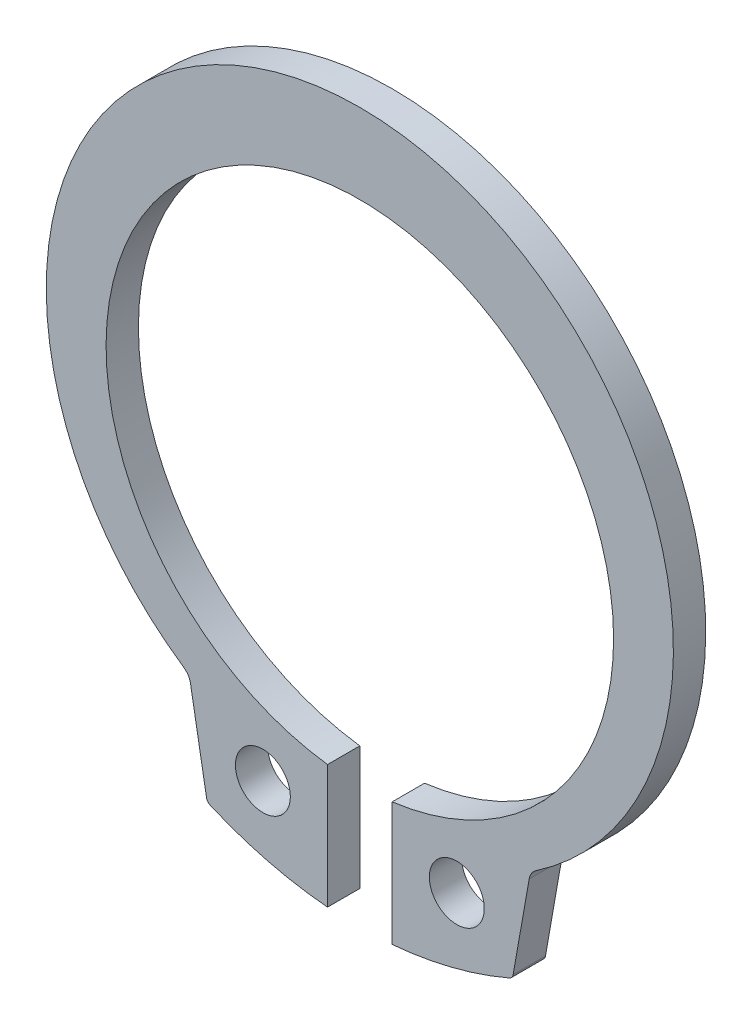
ISO-10303-21;
HEADER;
FILE_DESCRIPTION(('STEP AP214'),'2;1');
FILE_NAME('part.step','',(''),(''),'','','');
FILE_SCHEMA(('AUTOMOTIVE_DESIGN { 1 0 10303 214 1 1 1 1 }'));
ENDSEC;
DATA;
#1=APPLICATION_CONTEXT('core data for automotive mechanical design processes');
#2=APPLICATION_PROTOCOL_DEFINITION('international standard','automotive_design',2000,#1);
#3=PRODUCT_CONTEXT('',#1,'mechanical');
#4=PRODUCT('Part','Part','',(#3));
#5=PRODUCT_RELATED_PRODUCT_CATEGORY('part','',(#4));
#6=PRODUCT_DEFINITION_FORMATION('','',#4);
#7=PRODUCT_DEFINITION_CONTEXT('part definition',#1,'design');
#8=PRODUCT_DEFINITION('design','',#6,#7);
#9=PRODUCT_DEFINITION_SHAPE('','',#8);
#10=(LENGTH_UNIT() NAMED_UNIT(*) SI_UNIT(.MILLI.,.METRE.));
#11=(NAMED_UNIT(*) PLANE_ANGLE_UNIT() SI_UNIT($,.RADIAN.));
#12=(NAMED_UNIT(*) SI_UNIT($,.STERADIAN.) SOLID_ANGLE_UNIT());
#13=UNCERTAINTY_MEASURE_WITH_UNIT(LENGTH_MEASURE(1.E-05),#10,'distance_accuracy_value','');
#14=(GEOMETRIC_REPRESENTATION_CONTEXT(3) GLOBAL_UNCERTAINTY_ASSIGNED_CONTEXT((#13)) GLOBAL_UNIT_ASSIGNED_CONTEXT((#10,
#11,#12)) REPRESENTATION_CONTEXT('',''));
#15=CARTESIAN_POINT('',(0.,0.,0.));
#16=DIRECTION('',(0.,0.,1.));
#17=DIRECTION('',(1.,0.,0.));
#18=AXIS2_PLACEMENT_3D('',#15,#16,#17);
#19=CARTESIAN_POINT('',(0.,-0.62,-1.));
#20=DIRECTION('',(0.,0.,1.));
#21=DIRECTION('',(1.,0.,0.));
#22=AXIS2_PLACEMENT_3D('',#19,#20,#21);
#23=CYLINDRICAL_SURFACE('',#22,11.65);
#24=CARTESIAN_POINT('',(0.,-0.62,-1.));
#25=DIRECTION('',(0.,0.,1.));
#26=DIRECTION('',(-1.,0.,0.));
#27=AXIS2_PLACEMENT_3D('',#24,#25,#26);
#28=CIRCLE('',#27,11.65);
#29=CARTESIAN_POINT('',(1.,-12.2270021969499,-1.));
#30=VERTEX_POINT('',#29);
#31=CARTESIAN_POINT('',(4.62513197829559,-11.3125513411602,-1.));
#32=VERTEX_POINT('',#31);
#33=EDGE_CURVE('E174',#30,#32,#28,.T.);
#34=ORIENTED_EDGE('',*,*,#33,.T.);
#35=DIRECTION('',(0.,0.,1.));
#36=VECTOR('',#35,1.);
#37=CARTESIAN_POINT('',(4.62513197829559,-11.3125513411602,-1.));
#38=LINE('',#37,#36);
#39=CARTESIAN_POINT('',(4.62513197829559,-11.3125513411602,0.));
#40=VERTEX_POINT('',#39);
#41=EDGE_CURVE('E192',#32,#40,#38,.T.);
#42=ORIENTED_EDGE('',*,*,#41,.T.);
#43=CARTESIAN_POINT('',(0.,-0.62,0.));
#44=DIRECTION('',(0.,0.,1.));
#45=DIRECTION('',(-1.,0.,0.));
#46=AXIS2_PLACEMENT_3D('',#43,#44,#45);
#47=CIRCLE('',#46,11.65);
#48=CARTESIAN_POINT('',(1.,-12.2270021969499,0.));
#49=VERTEX_POINT('',#48);
#50=EDGE_CURVE('E154',#49,#40,#47,.T.);
#51=ORIENTED_EDGE('',*,*,#50,.F.);
#52=DIRECTION('',(0.,0.,1.));
#53=VECTOR('',#52,1.);
#54=CARTESIAN_POINT('',(1.,-12.2270021969499,-1.));
#55=LINE('',#54,#53);
#56=EDGE_CURVE('E175',#30,#49,#55,.T.);
#57=ORIENTED_EDGE('',*,*,#56,.F.);
#58=EDGE_LOOP('',(#34,#42,#51,#57));
#59=FACE_BOUND('',#58,.T.);
#60=ADVANCED_FACE('F33',(#59),#23,.T.);
#61=CARTESIAN_POINT('',(1.,-8.40604520921886,-1.));
#62=DIRECTION('',(-1.,0.,0.));
#63=DIRECTION('',(0.,0.,1.));
#64=AXIS2_PLACEMENT_3D('',#61,#62,#63);
#65=PLANE('',#64);
#66=DIRECTION('',(0.,-1.,0.));
#67=VECTOR('',#66,1.);
#68=CARTESIAN_POINT('',(1.,-8.40604520921886,0.));
#69=LINE('',#68,#67);
#70=CARTESIAN_POINT('',(1.,-8.40604520921886,0.));
#71=VERTEX_POINT('',#70);
#72=EDGE_CURVE('E171',#71,#49,#69,.T.);
#73=ORIENTED_EDGE('',*,*,#72,.F.);
#74=DIRECTION('',(0.,0.,1.));
#75=VECTOR('',#74,1.);
#76=CARTESIAN_POINT('',(1.,-8.40604520921886,-1.));
#77=LINE('',#76,#75);
#78=CARTESIAN_POINT('',(1.,-8.40604520921886,-1.));
#79=VERTEX_POINT('',#78);
#80=EDGE_CURVE('E178',#79,#71,#77,.T.);
#81=ORIENTED_EDGE('',*,*,#80,.F.);
#82=DIRECTION('',(0.,-1.,0.));
#83=VECTOR('',#82,1.);
#84=CARTESIAN_POINT('',(1.,-8.40604520921886,-1.));
#85=LINE('',#84,#83);
#86=EDGE_CURVE('E141',#79,#30,#85,.T.);
#87=ORIENTED_EDGE('',*,*,#86,.T.);
#88=ORIENTED_EDGE('',*,*,#56,.T.);
#89=EDGE_LOOP('',(#73,#81,#87,#88));
#90=FACE_BOUND('',#89,.T.);
#91=ADVANCED_FACE('F273',(#90),#65,.T.);
#92=CARTESIAN_POINT('',(0.,-0.62,-1.));
#93=DIRECTION('',(0.,0.,1.));
#94=DIRECTION('',(1.,0.,0.));
#95=AXIS2_PLACEMENT_3D('',#92,#93,#94);
#96=CYLINDRICAL_SURFACE('',#95,7.85);
#97=CARTESIAN_POINT('',(0.,-0.62,0.));
#98=DIRECTION('',(0.,0.,-1.));
#99=DIRECTION('',(1.,0.,0.));
#100=AXIS2_PLACEMENT_3D('',#97,#98,#99);
#101=CIRCLE('',#100,7.85);
#102=CARTESIAN_POINT('',(-1.00000000000001,-8.40604520921886,0.));
#103=VERTEX_POINT('',#102);
#104=EDGE_CURVE('E168',#103,#71,#101,.T.);
#105=ORIENTED_EDGE('',*,*,#104,.F.);
#106=DIRECTION('',(0.,0.,1.));
#107=VECTOR('',#106,1.);
#108=CARTESIAN_POINT('',(-1.00000000000001,-8.40604520921886,-1.));
#109=LINE('',#108,#107);
#110=CARTESIAN_POINT('',(-1.00000000000001,-8.40604520921886,-1.));
#111=VERTEX_POINT('',#110);
#112=EDGE_CURVE('E140',#111,#103,#109,.T.);
#113=ORIENTED_EDGE('',*,*,#112,.F.);
#114=CARTESIAN_POINT('',(0.,-0.62,-1.));
#115=DIRECTION('',(0.,0.,-1.));
#116=DIRECTION('',(1.,0.,0.));
#117=AXIS2_PLACEMENT_3D('',#114,#115,#116);
#118=CIRCLE('',#117,7.85);
#119=EDGE_CURVE('E147',#111,#79,#118,.T.);
#120=ORIENTED_EDGE('',*,*,#119,.T.);
#121=ORIENTED_EDGE('',*,*,#80,.T.);
#122=EDGE_LOOP('',(#105,#113,#120,#121));
#123=FACE_BOUND('',#122,.T.);
#124=ADVANCED_FACE('F279',(#123),#96,.F.);
#125=CARTESIAN_POINT('',(-1.,-8.40604520921886,-1.));
#126=DIRECTION('',(1.,0.,0.));
#127=DIRECTION('',(0.,0.,-1.));
#128=AXIS2_PLACEMENT_3D('',#125,#126,#127);
#129=PLANE('',#128);
#130=DIRECTION('',(0.,1.,0.));
#131=VECTOR('',#130,1.);
#132=CARTESIAN_POINT('',(-1.,-8.40604520921886,0.));
#133=LINE('',#132,#131);
#134=CARTESIAN_POINT('',(-1.,-12.2270021969499,0.));
#135=VERTEX_POINT('',#134);
#136=EDGE_CURVE('E139',#135,#103,#133,.T.);
#137=ORIENTED_EDGE('',*,*,#136,.F.);
#138=DIRECTION('',(0.,0.,1.));
#139=VECTOR('',#138,1.);
#140=CARTESIAN_POINT('',(-1.,-12.2270021969499,-1.));
#141=LINE('',#140,#139);
#142=CARTESIAN_POINT('',(-1.,-12.2270021969499,-1.));
#143=VERTEX_POINT('',#142);
#144=EDGE_CURVE('E124',#143,#135,#141,.T.);
#145=ORIENTED_EDGE('',*,*,#144,.F.);
#146=DIRECTION('',(0.,1.,0.));
#147=VECTOR('',#146,1.);
#148=CARTESIAN_POINT('',(-1.,-8.40604520921886,-1.));
#149=LINE('',#148,#147);
#150=EDGE_CURVE('E132',#143,#111,#149,.T.);
#151=ORIENTED_EDGE('',*,*,#150,.T.);
#152=ORIENTED_EDGE('',*,*,#112,.T.);
#153=EDGE_LOOP('',(#137,#145,#151,#152));
#154=FACE_BOUND('',#153,.T.);
#155=ADVANCED_FACE('F137',(#154),#129,.T.);
#156=CARTESIAN_POINT('',(0.,-0.62,-1.));
#157=DIRECTION('',(0.,0.,1.));
#158=DIRECTION('',(1.,0.,0.));
#159=AXIS2_PLACEMENT_3D('',#156,#157,#158);
#160=CYLINDRICAL_SURFACE('',#159,11.65);
#161=CARTESIAN_POINT('',(0.,-0.62,0.));
#162=DIRECTION('',(0.,0.,1.));
#163=DIRECTION('',(1.,0.,0.));
#164=AXIS2_PLACEMENT_3D('',#161,#162,#163);
#165=CIRCLE('',#164,11.65);
#166=CARTESIAN_POINT('',(-4.62513197829559,-11.3125513411602,0.));
#167=VERTEX_POINT('',#166);
#168=EDGE_CURVE('E165',#167,#135,#165,.T.);
#169=ORIENTED_EDGE('',*,*,#168,.F.);
#170=DIRECTION('',(0.,0.,1.));
#171=VECTOR('',#170,1.);
#172=CARTESIAN_POINT('',(-4.62513197829559,-11.3125513411602,-1.));
#173=LINE('',#172,#171);
#174=CARTESIAN_POINT('',(-4.62513197829559,-11.3125513411602,-1.));
#175=VERTEX_POINT('',#174);
#176=EDGE_CURVE('E127',#167,#175,#173,.F.);
#177=ORIENTED_EDGE('',*,*,#176,.T.);
#178=CARTESIAN_POINT('',(0.,-0.62,-1.));
#179=DIRECTION('',(0.,0.,1.));
#180=DIRECTION('',(1.,0.,0.));
#181=AXIS2_PLACEMENT_3D('',#178,#179,#180);
#182=CIRCLE('',#181,11.65);
#183=EDGE_CURVE('E120',#175,#143,#182,.T.);
#184=ORIENTED_EDGE('',*,*,#183,.T.);
#185=ORIENTED_EDGE('',*,*,#144,.T.);
#186=EDGE_LOOP('',(#169,#177,#184,#185));
#187=FACE_BOUND('',#186,.T.);
#188=ADVANCED_FACE('F123',(#187),#160,.T.);
#189=CARTESIAN_POINT('',(-5.27590710666714,-8.13970541247158,-1.));
#190=DIRECTION('',(-0.984807753012208,-0.173648177666931,0.));
#191=DIRECTION('',(0.173648177666931,-0.984807753012208,0.));
#192=AXIS2_PLACEMENT_3D('',#189,#190,#191);
#193=PLANE('',#192);
#194=DIRECTION('',(0.173648177666931,-0.984807753012208,0.));
#195=VECTOR('',#194,1.);
#196=CARTESIAN_POINT('',(-5.27590710666714,-8.13970541247158,0.));
#197=LINE('',#196,#195);
#198=CARTESIAN_POINT('',(-5.23867219940351,-8.35087506509092,0.));
#199=VERTEX_POINT('',#198);
#200=CARTESIAN_POINT('',(-4.74269212154532,-11.1637178635407,0.));
#201=VERTEX_POINT('',#200);
#202=EDGE_CURVE('E163',#199,#201,#197,.T.);
#203=ORIENTED_EDGE('',*,*,#202,.F.);
#204=DIRECTION('',(0.,0.,-1.));
#205=VECTOR('',#204,1.);
#206=CARTESIAN_POINT('',(-5.23867219940351,-8.35087506509092,-1.));
#207=LINE('',#206,#205);
#208=CARTESIAN_POINT('',(-5.23867219940351,-8.35087506509092,-1.));
#209=VERTEX_POINT('',#208);
#210=EDGE_CURVE('E54',#199,#209,#207,.T.);
#211=ORIENTED_EDGE('',*,*,#210,.T.);
#212=DIRECTION('',(0.173648177666931,-0.984807753012208,0.));
#213=VECTOR('',#212,1.);
#214=CARTESIAN_POINT('',(-5.27590710666714,-8.13970541247158,-1.));
#215=LINE('',#214,#213);
#216=CARTESIAN_POINT('',(-4.74269212154532,-11.1637178635407,-1.));
#217=VERTEX_POINT('',#216);
#218=EDGE_CURVE('E133',#209,#217,#215,.T.);
#219=ORIENTED_EDGE('',*,*,#218,.T.);
#220=DIRECTION('',(0.,0.,1.));
#221=VECTOR('',#220,1.);
#222=CARTESIAN_POINT('',(-4.74269212154532,-11.1637178635407,-1.));
#223=LINE('',#222,#221);
#224=EDGE_CURVE('E177',#217,#201,#223,.T.);
#225=ORIENTED_EDGE('',*,*,#224,.T.);
#226=EDGE_LOOP('',(#203,#211,#219,#225));
#227=FACE_BOUND('',#226,.T.);
#228=ADVANCED_FACE('F332',(#227),#193,.T.);
#229=CARTESIAN_POINT('',(0.,0.,-1.));
#230=DIRECTION('',(0.,0.,1.));
#231=DIRECTION('',(1.,0.,0.));
#232=AXIS2_PLACEMENT_3D('',#229,#230,#231);
#233=CYLINDRICAL_SURFACE('',#232,9.7);
#234=CARTESIAN_POINT('',(0.,0.,0.));
#235=DIRECTION('',(0.,0.,1.));
#236=DIRECTION('',(1.,0.,0.));
#237=AXIS2_PLACEMENT_3D('',#234,#235,#236);
#238=CIRCLE('',#237,9.7);
#239=CARTESIAN_POINT('',(5.45014097414934,-8.02408645030065,0.));
#240=VERTEX_POINT('',#239);
#241=CARTESIAN_POINT('',(-5.45014097414934,-8.02408645030065,0.));
#242=VERTEX_POINT('',#241);
#243=EDGE_CURVE('E161',#240,#242,#238,.T.);
#244=ORIENTED_EDGE('',*,*,#243,.F.);
#245=DIRECTION('',(0.,0.,1.));
#246=VECTOR('',#245,1.);
#247=CARTESIAN_POINT('',(5.45014097414934,-8.02408645030065,-1.));
#248=LINE('',#247,#246);
#249=CARTESIAN_POINT('',(5.45014097414934,-8.02408645030065,-1.));
#250=VERTEX_POINT('',#249);
#251=EDGE_CURVE('E203',#240,#250,#248,.F.);
#252=ORIENTED_EDGE('',*,*,#251,.T.);
#253=CARTESIAN_POINT('',(0.,0.,-1.));
#254=DIRECTION('',(0.,0.,1.));
#255=DIRECTION('',(1.,0.,0.));
#256=AXIS2_PLACEMENT_3D('',#253,#254,#255);
#257=CIRCLE('',#256,9.7);
#258=CARTESIAN_POINT('',(-5.45014097414934,-8.02408645030065,-1.));
#259=VERTEX_POINT('',#258);
#260=EDGE_CURVE('E216',#250,#259,#257,.T.);
#261=ORIENTED_EDGE('',*,*,#260,.T.);
#262=DIRECTION('',(0.,0.,1.));
#263=VECTOR('',#262,1.);
#264=CARTESIAN_POINT('',(-5.45014097414934,-8.02408645030065,-1.));
#265=LINE('',#264,#263);
#266=EDGE_CURVE('E200',#259,#242,#265,.T.);
#267=ORIENTED_EDGE('',*,*,#266,.T.);
#268=EDGE_LOOP('',(#244,#252,#261,#267));
#269=FACE_BOUND('',#268,.T.);
#270=ADVANCED_FACE('F229',(#269),#233,.T.);
#271=CARTESIAN_POINT('',(5.27590710666714,-8.13970541247158,-1.));
#272=DIRECTION('',(0.984807753012208,-0.173648177666931,0.));
#273=DIRECTION('',(0.173648177666931,0.984807753012208,0.));
#274=AXIS2_PLACEMENT_3D('',#271,#272,#273);
#275=PLANE('',#274);
#276=DIRECTION('',(0.173648177666931,0.984807753012208,0.));
#277=VECTOR('',#276,1.);
#278=CARTESIAN_POINT('',(5.27590710666714,-8.13970541247158,-1.));
#279=LINE('',#278,#277);
#280=CARTESIAN_POINT('',(4.74269212154532,-11.1637178635407,-1.));
#281=VERTEX_POINT('',#280);
#282=CARTESIAN_POINT('',(5.23867219940351,-8.35087506509092,-1.));
#283=VERTEX_POINT('',#282);
#284=EDGE_CURVE('E213',#281,#283,#279,.T.);
#285=ORIENTED_EDGE('',*,*,#284,.T.);
#286=DIRECTION('',(0.,0.,-1.));
#287=VECTOR('',#286,1.);
#288=CARTESIAN_POINT('',(5.23867219940351,-8.35087506509092,0.));
#289=LINE('',#288,#287);
#290=CARTESIAN_POINT('',(5.23867219940351,-8.35087506509092,0.));
#291=VERTEX_POINT('',#290);
#292=EDGE_CURVE('E197',#283,#291,#289,.F.);
#293=ORIENTED_EDGE('',*,*,#292,.T.);
#294=DIRECTION('',(0.173648177666931,0.984807753012208,0.));
#295=VECTOR('',#294,1.);
#296=CARTESIAN_POINT('',(5.27590710666714,-8.13970541247158,0.));
#297=LINE('',#296,#295);
#298=CARTESIAN_POINT('',(4.74269212154532,-11.1637178635407,0.));
#299=VERTEX_POINT('',#298);
#300=EDGE_CURVE('E157',#299,#291,#297,.T.);
#301=ORIENTED_EDGE('',*,*,#300,.F.);
#302=DIRECTION('',(0.,0.,1.));
#303=VECTOR('',#302,1.);
#304=CARTESIAN_POINT('',(4.74269212154532,-11.1637178635407,-1.));
#305=LINE('',#304,#303);
#306=EDGE_CURVE('E195',#299,#281,#305,.F.);
#307=ORIENTED_EDGE('',*,*,#306,.T.);
#308=EDGE_LOOP('',(#285,#293,#301,#307));
#309=FACE_BOUND('',#308,.T.);
#310=ADVANCED_FACE('F221',(#309),#275,.T.);
#311=CARTESIAN_POINT('',(0.,-0.62,-1.));
#312=DIRECTION('',(0.,0.,-1.));
#313=DIRECTION('',(-1.,0.,0.));
#314=AXIS2_PLACEMENT_3D('',#311,#312,#313);
#315=PLANE('',#314);
#316=CARTESIAN_POINT('',(3.,-9.84442410126507,-1.));
#317=DIRECTION('',(0.,0.,1.));
#318=DIRECTION('',(-1.,0.,0.));
#319=AXIS2_PLACEMENT_3D('',#316,#317,#318);
#320=CIRCLE('',#319,0.85);
#321=CARTESIAN_POINT('',(2.15,-9.84442410126507,-1.));
#322=VERTEX_POINT('',#321);
#323=EDGE_CURVE('E241',#322,#322,#320,.T.);
#324=ORIENTED_EDGE('',*,*,#323,.T.);
#325=EDGE_LOOP('',(#324));
#326=FACE_BOUND('',#325,.T.);
#327=CARTESIAN_POINT('',(-3.,-9.84442410126507,-1.));
#328=DIRECTION('',(0.,0.,1.));
#329=DIRECTION('',(1.,0.,0.));
#330=AXIS2_PLACEMENT_3D('',#327,#328,#329);
#331=CIRCLE('',#330,0.85);
#332=CARTESIAN_POINT('',(-2.15,-9.84442410126507,-1.));
#333=VERTEX_POINT('',#332);
#334=EDGE_CURVE('E158',#333,#333,#331,.T.);
#335=ORIENTED_EDGE('',*,*,#334,.T.);
#336=EDGE_LOOP('',(#335));
#337=FACE_BOUND('',#336,.T.);
#338=ORIENTED_EDGE('',*,*,#183,.F.);
#339=CARTESIAN_POINT('',(-4.54573057094288,-11.1289882280073,-1.));
#340=DIRECTION('',(0.,0.,-1.));
#341=DIRECTION('',(-1.,0.,0.));
#342=AXIS2_PLACEMENT_3D('',#339,#340,#341);
#343=CIRCLE('',#342,0.2);
#344=EDGE_CURVE('E190',#175,#217,#343,.T.);
#345=ORIENTED_EDGE('',*,*,#344,.T.);
#346=ORIENTED_EDGE('',*,*,#218,.F.);
#347=CARTESIAN_POINT('',(-5.73107607590962,-8.43769915392439,-1.));
#348=DIRECTION('',(0.,0.,-1.));
#349=DIRECTION('',(-1.,0.,0.));
#350=AXIS2_PLACEMENT_3D('',#347,#348,#349);
#351=CIRCLE('',#350,0.5);
#352=EDGE_CURVE('E11',#209,#259,#351,.F.);
#353=ORIENTED_EDGE('',*,*,#352,.T.);
#354=ORIENTED_EDGE('',*,*,#260,.F.);
#355=CARTESIAN_POINT('',(5.73107607590962,-8.43769915392439,-1.));
#356=DIRECTION('',(0.,0.,-1.));
#357=DIRECTION('',(-1.,0.,0.));
#358=AXIS2_PLACEMENT_3D('',#355,#356,#357);
#359=CIRCLE('',#358,0.5);
#360=EDGE_CURVE('E208',#250,#283,#359,.F.);
#361=ORIENTED_EDGE('',*,*,#360,.T.);
#362=ORIENTED_EDGE('',*,*,#284,.F.);
#363=CARTESIAN_POINT('',(4.54573057094288,-11.1289882280073,-1.));
#364=DIRECTION('',(0.,0.,-1.));
#365=DIRECTION('',(-1.,0.,0.));
#366=AXIS2_PLACEMENT_3D('',#363,#364,#365);
#367=CIRCLE('',#366,0.2);
#368=EDGE_CURVE('E188',#281,#32,#367,.T.);
#369=ORIENTED_EDGE('',*,*,#368,.T.);
#370=ORIENTED_EDGE('',*,*,#33,.F.);
#371=ORIENTED_EDGE('',*,*,#86,.F.);
#372=ORIENTED_EDGE('',*,*,#119,.F.);
#373=ORIENTED_EDGE('',*,*,#150,.F.);
#374=EDGE_LOOP('',(#338,#345,#346,#353,#354,#361,#362,#369,#370,#371,#372,#373));
#375=FACE_BOUND('',#374,.T.);
#376=ADVANCED_FACE('F144',(#326,#337,#375),#315,.T.);
#377=CARTESIAN_POINT('',(0.,-0.62,0.));
#378=DIRECTION('',(0.,0.,-1.));
#379=DIRECTION('',(-1.,0.,0.));
#380=AXIS2_PLACEMENT_3D('',#377,#378,#379);
#381=PLANE('',#380);
#382=CARTESIAN_POINT('',(3.,-9.84442410126507,0.));
#383=DIRECTION('',(0.,0.,1.));
#384=DIRECTION('',(-1.,0.,0.));
#385=AXIS2_PLACEMENT_3D('',#382,#383,#384);
#386=CIRCLE('',#385,0.85);
#387=CARTESIAN_POINT('',(2.15,-9.84442410126507,0.));
#388=VERTEX_POINT('',#387);
#389=EDGE_CURVE('E244',#388,#388,#386,.T.);
#390=ORIENTED_EDGE('',*,*,#389,.F.);
#391=EDGE_LOOP('',(#390));
#392=FACE_BOUND('',#391,.T.);
#393=CARTESIAN_POINT('',(-3.,-9.84442410126507,0.));
#394=DIRECTION('',(0.,0.,1.));
#395=DIRECTION('',(1.,0.,0.));
#396=AXIS2_PLACEMENT_3D('',#393,#394,#395);
#397=CIRCLE('',#396,0.85);
#398=CARTESIAN_POINT('',(-2.15,-9.84442410126507,0.));
#399=VERTEX_POINT('',#398);
#400=EDGE_CURVE('E238',#399,#399,#397,.T.);
#401=ORIENTED_EDGE('',*,*,#400,.F.);
#402=EDGE_LOOP('',(#401));
#403=FACE_BOUND('',#402,.T.);
#404=ORIENTED_EDGE('',*,*,#243,.T.);
#405=CARTESIAN_POINT('',(-5.73107607590962,-8.43769915392439,0.));
#406=DIRECTION('',(0.,0.,-1.));
#407=DIRECTION('',(-1.,0.,0.));
#408=AXIS2_PLACEMENT_3D('',#405,#406,#407);
#409=CIRCLE('',#408,0.5);
#410=EDGE_CURVE('E41',#242,#199,#409,.T.);
#411=ORIENTED_EDGE('',*,*,#410,.T.);
#412=ORIENTED_EDGE('',*,*,#202,.T.);
#413=CARTESIAN_POINT('',(-4.54573057094288,-11.1289882280073,0.));
#414=DIRECTION('',(0.,0.,-1.));
#415=DIRECTION('',(-1.,0.,0.));
#416=AXIS2_PLACEMENT_3D('',#413,#414,#415);
#417=CIRCLE('',#416,0.2);
#418=EDGE_CURVE('E185',#201,#167,#417,.F.);
#419=ORIENTED_EDGE('',*,*,#418,.T.);
#420=ORIENTED_EDGE('',*,*,#168,.T.);
#421=ORIENTED_EDGE('',*,*,#136,.T.);
#422=ORIENTED_EDGE('',*,*,#104,.T.);
#423=ORIENTED_EDGE('',*,*,#72,.T.);
#424=ORIENTED_EDGE('',*,*,#50,.T.);
#425=CARTESIAN_POINT('',(4.54573057094288,-11.1289882280073,0.));
#426=DIRECTION('',(0.,0.,-1.));
#427=DIRECTION('',(-1.,0.,0.));
#428=AXIS2_PLACEMENT_3D('',#425,#426,#427);
#429=CIRCLE('',#428,0.2);
#430=EDGE_CURVE('E183',#40,#299,#429,.F.);
#431=ORIENTED_EDGE('',*,*,#430,.T.);
#432=ORIENTED_EDGE('',*,*,#300,.T.);
#433=CARTESIAN_POINT('',(5.73107607590962,-8.43769915392439,0.));
#434=DIRECTION('',(0.,0.,-1.));
#435=DIRECTION('',(-1.,0.,0.));
#436=AXIS2_PLACEMENT_3D('',#433,#434,#435);
#437=CIRCLE('',#436,0.5);
#438=EDGE_CURVE('E206',#291,#240,#437,.T.);
#439=ORIENTED_EDGE('',*,*,#438,.T.);
#440=EDGE_LOOP('',(#404,#411,#412,#419,#420,#421,#422,#423,#424,#431,#432,#439));
#441=FACE_BOUND('',#440,.T.);
#442=ADVANCED_FACE('F227',(#392,#403,#441),#381,.F.);
#443=CARTESIAN_POINT('',(-3.,-9.84442410126507,-1.));
#444=DIRECTION('',(0.,0.,1.));
#445=DIRECTION('',(1.,0.,0.));
#446=AXIS2_PLACEMENT_3D('',#443,#444,#445);
#447=CYLINDRICAL_SURFACE('',#446,0.85);
#448=ORIENTED_EDGE('',*,*,#334,.F.);
#449=EDGE_LOOP('',(#448));
#450=FACE_BOUND('',#449,.T.);
#451=ORIENTED_EDGE('',*,*,#400,.T.);
#452=EDGE_LOOP('',(#451));
#453=FACE_BOUND('',#452,.T.);
#454=ADVANCED_FACE('F256',(#450,#453),#447,.F.);
#455=CARTESIAN_POINT('',(3.,-9.84442410126507,-1.));
#456=DIRECTION('',(0.,0.,1.));
#457=DIRECTION('',(1.,0.,0.));
#458=AXIS2_PLACEMENT_3D('',#455,#456,#457);
#459=CYLINDRICAL_SURFACE('',#458,0.85);
#460=ORIENTED_EDGE('',*,*,#323,.F.);
#461=EDGE_LOOP('',(#460));
#462=FACE_BOUND('',#461,.T.);
#463=ORIENTED_EDGE('',*,*,#389,.T.);
#464=EDGE_LOOP('',(#463));
#465=FACE_BOUND('',#464,.T.);
#466=ADVANCED_FACE('F252',(#462,#465),#459,.F.);
#467=CARTESIAN_POINT('',(-4.54573057094288,-11.1289882280073,-1.));
#468=DIRECTION('',(0.,0.,1.));
#469=DIRECTION('',(1.,0.,0.));
#470=AXIS2_PLACEMENT_3D('',#467,#468,#469);
#471=CYLINDRICAL_SURFACE('',#470,0.2);
#472=ORIENTED_EDGE('',*,*,#344,.F.);
#473=ORIENTED_EDGE('',*,*,#176,.F.);
#474=ORIENTED_EDGE('',*,*,#418,.F.);
#475=ORIENTED_EDGE('',*,*,#224,.F.);
#476=EDGE_LOOP('',(#472,#473,#474,#475));
#477=FACE_BOUND('',#476,.T.);
#478=ADVANCED_FACE('F255',(#477),#471,.T.);
#479=CARTESIAN_POINT('',(4.54573057094288,-11.1289882280073,-1.));
#480=DIRECTION('',(0.,0.,1.));
#481=DIRECTION('',(1.,0.,0.));
#482=AXIS2_PLACEMENT_3D('',#479,#480,#481);
#483=CYLINDRICAL_SURFACE('',#482,0.2);
#484=ORIENTED_EDGE('',*,*,#368,.F.);
#485=ORIENTED_EDGE('',*,*,#306,.F.);
#486=ORIENTED_EDGE('',*,*,#430,.F.);
#487=ORIENTED_EDGE('',*,*,#41,.F.);
#488=EDGE_LOOP('',(#484,#485,#486,#487));
#489=FACE_BOUND('',#488,.T.);
#490=ADVANCED_FACE('F287',(#489),#483,.T.);
#491=CARTESIAN_POINT('',(5.73107607590962,-8.43769915392439,-1.));
#492=DIRECTION('',(0.,0.,1.));
#493=DIRECTION('',(1.,0.,0.));
#494=AXIS2_PLACEMENT_3D('',#491,#492,#493);
#495=CYLINDRICAL_SURFACE('',#494,0.5);
#496=ORIENTED_EDGE('',*,*,#360,.F.);
#497=ORIENTED_EDGE('',*,*,#251,.F.);
#498=ORIENTED_EDGE('',*,*,#438,.F.);
#499=ORIENTED_EDGE('',*,*,#292,.F.);
#500=EDGE_LOOP('',(#496,#497,#498,#499));
#501=FACE_BOUND('',#500,.T.);
#502=ADVANCED_FACE('F225',(#501),#495,.F.);
#503=CARTESIAN_POINT('',(-5.73107607590962,-8.43769915392439,-1.));
#504=DIRECTION('',(0.,0.,1.));
#505=DIRECTION('',(1.,0.,0.));
#506=AXIS2_PLACEMENT_3D('',#503,#504,#505);
#507=CYLINDRICAL_SURFACE('',#506,0.5);
#508=ORIENTED_EDGE('',*,*,#352,.F.);
#509=ORIENTED_EDGE('',*,*,#210,.F.);
#510=ORIENTED_EDGE('',*,*,#410,.F.);
#511=ORIENTED_EDGE('',*,*,#266,.F.);
#512=EDGE_LOOP('',(#508,#509,#510,#511));
#513=FACE_BOUND('',#512,.T.);
#514=ADVANCED_FACE('F35',(#513),#507,.F.);
#515=CLOSED_SHELL('',(#60,#91,#124,#155,#188,#228,#270,#310,#376,#442,#454,#466,#478,#490,#502,#514));
#516=MANIFOLD_SOLID_BREP('B2',#515);
#517=ADVANCED_BREP_SHAPE_REPRESENTATION('',(#18,#516),#14);
#518=SHAPE_DEFINITION_REPRESENTATION(#9,#517);
ENDSEC;
END-ISO-10303-21;
